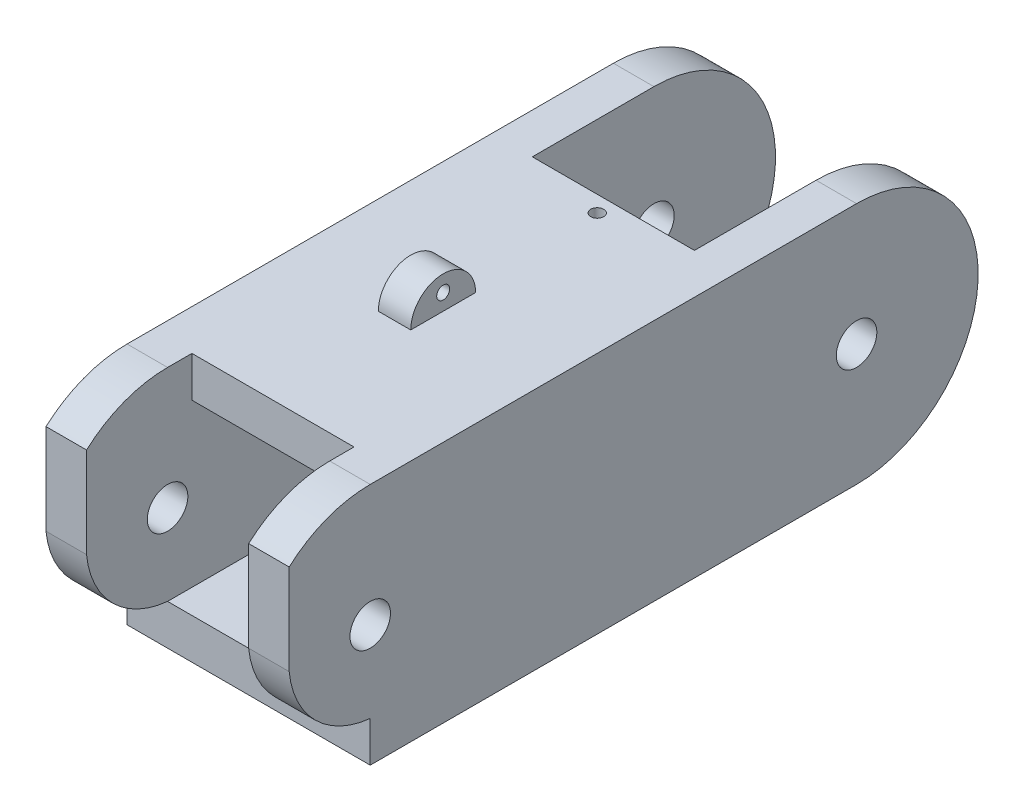
ISO-10303-21;
HEADER;
FILE_DESCRIPTION(('STEP AP214'),'2;1');
FILE_NAME('part.step','',(''),(''),'','','');
FILE_SCHEMA(('AUTOMOTIVE_DESIGN { 1 0 10303 214 1 1 1 1 }'));
ENDSEC;
DATA;
#1=APPLICATION_CONTEXT('core data for automotive mechanical design processes');
#2=APPLICATION_PROTOCOL_DEFINITION('international standard','automotive_design',2000,#1);
#3=PRODUCT_CONTEXT('',#1,'mechanical');
#4=PRODUCT('Part','Part','',(#3));
#5=PRODUCT_RELATED_PRODUCT_CATEGORY('part','',(#4));
#6=PRODUCT_DEFINITION_FORMATION('','',#4);
#7=PRODUCT_DEFINITION_CONTEXT('part definition',#1,'design');
#8=PRODUCT_DEFINITION('design','',#6,#7);
#9=PRODUCT_DEFINITION_SHAPE('','',#8);
#10=(LENGTH_UNIT() NAMED_UNIT(*) SI_UNIT(.MILLI.,.METRE.));
#11=(NAMED_UNIT(*) PLANE_ANGLE_UNIT() SI_UNIT($,.RADIAN.));
#12=(NAMED_UNIT(*) SI_UNIT($,.STERADIAN.) SOLID_ANGLE_UNIT());
#13=UNCERTAINTY_MEASURE_WITH_UNIT(LENGTH_MEASURE(1.E-05),#10,'distance_accuracy_value','');
#14=(GEOMETRIC_REPRESENTATION_CONTEXT(3) GLOBAL_UNCERTAINTY_ASSIGNED_CONTEXT((#13)) GLOBAL_UNIT_ASSIGNED_CONTEXT((#10,
#11,#12)) REPRESENTATION_CONTEXT('',''));
#15=CARTESIAN_POINT('',(0.,0.,0.));
#16=DIRECTION('',(0.,0.,1.));
#17=DIRECTION('',(1.,0.,0.));
#18=AXIS2_PLACEMENT_3D('',#15,#16,#17);
#19=CARTESIAN_POINT('',(19.05,9.525,-9.525));
#20=DIRECTION('',(-1.,0.,0.));
#21=DIRECTION('',(0.,0.,1.));
#22=AXIS2_PLACEMENT_3D('',#19,#20,#21);
#23=CYLINDRICAL_SURFACE('',#22,9.525);
#24=CARTESIAN_POINT('',(0.,9.525,-9.525));
#25=DIRECTION('',(-1.,0.,0.));
#26=DIRECTION('',(0.,0.,-1.));
#27=AXIS2_PLACEMENT_3D('',#24,#25,#26);
#28=CIRCLE('',#27,9.525);
#29=CARTESIAN_POINT('',(0.,16.6245158285618,-3.175));
#30=VERTEX_POINT('',#29);
#31=CARTESIAN_POINT('',(0.,19.05,-9.525));
#32=VERTEX_POINT('',#31);
#33=EDGE_CURVE('E301',#30,#32,#28,.T.);
#34=ORIENTED_EDGE('',*,*,#33,.F.);
#35=DIRECTION('',(-1.,0.,0.));
#36=VECTOR('',#35,1.);
#37=CARTESIAN_POINT('',(19.05,16.6245158285618,-3.17500000000001));
#38=LINE('',#37,#36);
#39=CARTESIAN_POINT('',(3.175,16.6245158285618,-3.17500000000001));
#40=VERTEX_POINT('',#39);
#41=EDGE_CURVE('E464',#30,#40,#38,.F.);
#42=ORIENTED_EDGE('',*,*,#41,.T.);
#43=CARTESIAN_POINT('',(3.175,9.525,-9.525));
#44=DIRECTION('',(-1.,0.,0.));
#45=DIRECTION('',(0.,-1.,0.));
#46=AXIS2_PLACEMENT_3D('',#43,#44,#45);
#47=CIRCLE('',#46,9.525);
#48=CARTESIAN_POINT('',(3.17500000000001,19.05,-9.525));
#49=VERTEX_POINT('',#48);
#50=EDGE_CURVE('E232',#40,#49,#47,.T.);
#51=ORIENTED_EDGE('',*,*,#50,.T.);
#52=DIRECTION('',(-1.,0.,0.));
#53=VECTOR('',#52,1.);
#54=CARTESIAN_POINT('',(19.05,19.05,-9.525));
#55=LINE('',#54,#53);
#56=EDGE_CURVE('E300',#49,#32,#55,.T.);
#57=ORIENTED_EDGE('',*,*,#56,.T.);
#58=EDGE_LOOP('',(#34,#42,#51,#57));
#59=FACE_BOUND('',#58,.T.);
#60=ADVANCED_FACE('F39',(#59),#23,.T.);
#61=CARTESIAN_POINT('',(0.,19.05,0.));
#62=DIRECTION('',(1.,0.,0.));
#63=DIRECTION('',(0.,0.,-1.));
#64=AXIS2_PLACEMENT_3D('',#61,#62,#63);
#65=PLANE('',#64);
#66=CARTESIAN_POINT('',(0.,9.525,-9.525));
#67=DIRECTION('',(1.,0.,0.));
#68=DIRECTION('',(0.,0.,-1.));
#69=AXIS2_PLACEMENT_3D('',#66,#67,#68);
#70=CIRCLE('',#69,1.5875);
#71=CARTESIAN_POINT('',(0.,9.525,-11.1125));
#72=VERTEX_POINT('',#71);
#73=EDGE_CURVE('E237',#72,#72,#70,.T.);
#74=ORIENTED_EDGE('',*,*,#73,.T.);
#75=EDGE_LOOP('',(#74));
#76=FACE_BOUND('',#75,.T.);
#77=CARTESIAN_POINT('',(0.,9.525,-47.625));
#78=DIRECTION('',(1.,0.,0.));
#79=DIRECTION('',(0.,0.,-1.));
#80=AXIS2_PLACEMENT_3D('',#77,#78,#79);
#81=CIRCLE('',#80,1.5875);
#82=CARTESIAN_POINT('',(0.,9.525,-49.2125));
#83=VERTEX_POINT('',#82);
#84=EDGE_CURVE('E372',#83,#83,#81,.T.);
#85=ORIENTED_EDGE('',*,*,#84,.T.);
#86=EDGE_LOOP('',(#85));
#87=FACE_BOUND('',#86,.T.);
#88=DIRECTION('',(0.,1.,0.));
#89=VECTOR('',#88,1.);
#90=CARTESIAN_POINT('',(0.,0.,-9.525));
#91=LINE('',#90,#89);
#92=CARTESIAN_POINT('',(0.,0.,-9.525));
#93=VERTEX_POINT('',#92);
#94=CARTESIAN_POINT('',(0.,3.175,-9.525));
#95=VERTEX_POINT('',#94);
#96=EDGE_CURVE('E184',#93,#95,#91,.T.);
#97=ORIENTED_EDGE('',*,*,#96,.T.);
#98=CARTESIAN_POINT('',(0.,10.2236491395655,-10.2236491395655));
#99=DIRECTION('',(-1.,0.,0.));
#100=DIRECTION('',(0.,0.,-1.));
#101=AXIS2_PLACEMENT_3D('',#98,#99,#100);
#102=CIRCLE('',#101,7.08318892257665);
#103=CARTESIAN_POINT('',(0.,9.525,-3.175));
#104=VERTEX_POINT('',#103);
#105=EDGE_CURVE('E758',#95,#104,#102,.T.);
#106=ORIENTED_EDGE('',*,*,#105,.T.);
#107=DIRECTION('',(0.,1.,0.));
#108=VECTOR('',#107,1.);
#109=CARTESIAN_POINT('',(0.,9.525,-3.175));
#110=LINE('',#109,#108);
#111=EDGE_CURVE('E201',#104,#30,#110,.T.);
#112=ORIENTED_EDGE('',*,*,#111,.T.);
#113=ORIENTED_EDGE('',*,*,#33,.T.);
#114=DIRECTION('',(0.,0.,1.));
#115=VECTOR('',#114,1.);
#116=CARTESIAN_POINT('',(0.,19.05,0.));
#117=LINE('',#116,#115);
#118=CARTESIAN_POINT('',(0.,19.05,-47.625));
#119=VERTEX_POINT('',#118);
#120=EDGE_CURVE('E209',#119,#32,#117,.T.);
#121=ORIENTED_EDGE('',*,*,#120,.F.);
#122=CARTESIAN_POINT('',(0.,9.525,-47.625));
#123=DIRECTION('',(-1.,0.,0.));
#124=DIRECTION('',(0.,0.,-1.));
#125=AXIS2_PLACEMENT_3D('',#122,#123,#124);
#126=CIRCLE('',#125,9.525);
#127=CARTESIAN_POINT('',(0.,0.,-47.625));
#128=VERTEX_POINT('',#127);
#129=EDGE_CURVE('E491',#119,#128,#126,.T.);
#130=ORIENTED_EDGE('',*,*,#129,.T.);
#131=DIRECTION('',(0.,0.,1.));
#132=VECTOR('',#131,1.);
#133=CARTESIAN_POINT('',(0.,0.,0.));
#134=LINE('',#133,#132);
#135=EDGE_CURVE('E210',#128,#93,#134,.T.);
#136=ORIENTED_EDGE('',*,*,#135,.T.);
#137=EDGE_LOOP('',(#97,#106,#112,#113,#121,#130,#136));
#138=FACE_BOUND('',#137,.T.);
#139=ADVANCED_FACE('F41',(#76,#87,#138),#65,.F.);
#140=CARTESIAN_POINT('',(19.05,19.05,0.));
#141=DIRECTION('',(-1.,0.,0.));
#142=DIRECTION('',(0.,0.,1.));
#143=AXIS2_PLACEMENT_3D('',#140,#141,#142);
#144=PLANE('',#143);
#145=CARTESIAN_POINT('',(19.05,9.525,-9.525));
#146=DIRECTION('',(1.,0.,0.));
#147=DIRECTION('',(0.,0.,-1.));
#148=AXIS2_PLACEMENT_3D('',#145,#146,#147);
#149=CIRCLE('',#148,1.5875);
#150=CARTESIAN_POINT('',(19.05,9.525,-11.1125));
#151=VERTEX_POINT('',#150);
#152=EDGE_CURVE('E305',#151,#151,#149,.T.);
#153=ORIENTED_EDGE('',*,*,#152,.F.);
#154=EDGE_LOOP('',(#153));
#155=FACE_BOUND('',#154,.T.);
#156=CARTESIAN_POINT('',(19.05,9.525,-47.625));
#157=DIRECTION('',(1.,0.,0.));
#158=DIRECTION('',(0.,0.,-1.));
#159=AXIS2_PLACEMENT_3D('',#156,#157,#158);
#160=CIRCLE('',#159,1.5875);
#161=CARTESIAN_POINT('',(19.05,9.525,-49.2125));
#162=VERTEX_POINT('',#161);
#163=EDGE_CURVE('E243',#162,#162,#160,.T.);
#164=ORIENTED_EDGE('',*,*,#163,.F.);
#165=EDGE_LOOP('',(#164));
#166=FACE_BOUND('',#165,.T.);
#167=DIRECTION('',(0.,1.,0.));
#168=VECTOR('',#167,1.);
#169=CARTESIAN_POINT('',(19.05,0.,-9.525));
#170=LINE('',#169,#168);
#171=CARTESIAN_POINT('',(19.05,0.,-9.525));
#172=VERTEX_POINT('',#171);
#173=CARTESIAN_POINT('',(19.05,3.175,-9.525));
#174=VERTEX_POINT('',#173);
#175=EDGE_CURVE('E181',#172,#174,#170,.T.);
#176=ORIENTED_EDGE('',*,*,#175,.F.);
#177=DIRECTION('',(0.,0.,-1.));
#178=VECTOR('',#177,1.);
#179=CARTESIAN_POINT('',(19.05,0.,0.));
#180=LINE('',#179,#178);
#181=CARTESIAN_POINT('',(19.05,0.,-47.625));
#182=VERTEX_POINT('',#181);
#183=EDGE_CURVE('E198',#172,#182,#180,.T.);
#184=ORIENTED_EDGE('',*,*,#183,.T.);
#185=CARTESIAN_POINT('',(19.05,9.525,-47.625));
#186=DIRECTION('',(-1.,0.,0.));
#187=DIRECTION('',(0.,0.,-1.));
#188=AXIS2_PLACEMENT_3D('',#185,#186,#187);
#189=CIRCLE('',#188,9.525);
#190=CARTESIAN_POINT('',(19.05,19.05,-47.625));
#191=VERTEX_POINT('',#190);
#192=EDGE_CURVE('E492',#191,#182,#189,.T.);
#193=ORIENTED_EDGE('',*,*,#192,.F.);
#194=DIRECTION('',(0.,0.,-1.));
#195=VECTOR('',#194,1.);
#196=CARTESIAN_POINT('',(19.05,19.05,0.));
#197=LINE('',#196,#195);
#198=CARTESIAN_POINT('',(19.05,19.05,-9.525));
#199=VERTEX_POINT('',#198);
#200=EDGE_CURVE('E215',#199,#191,#197,.T.);
#201=ORIENTED_EDGE('',*,*,#200,.F.);
#202=CARTESIAN_POINT('',(19.05,9.525,-9.525));
#203=DIRECTION('',(-1.,0.,0.));
#204=DIRECTION('',(0.,0.,-1.));
#205=AXIS2_PLACEMENT_3D('',#202,#203,#204);
#206=CIRCLE('',#205,9.525);
#207=CARTESIAN_POINT('',(19.05,16.6245158285618,-3.175));
#208=VERTEX_POINT('',#207);
#209=EDGE_CURVE('E304',#208,#199,#206,.T.);
#210=ORIENTED_EDGE('',*,*,#209,.F.);
#211=DIRECTION('',(0.,1.,0.));
#212=VECTOR('',#211,1.);
#213=CARTESIAN_POINT('',(19.05,9.525,-3.175));
#214=LINE('',#213,#212);
#215=CARTESIAN_POINT('',(19.05,9.525,-3.175));
#216=VERTEX_POINT('',#215);
#217=EDGE_CURVE('E63',#216,#208,#214,.T.);
#218=ORIENTED_EDGE('',*,*,#217,.F.);
#219=CARTESIAN_POINT('',(19.05,10.2236491395655,-10.2236491395655));
#220=DIRECTION('',(-1.,0.,0.));
#221=DIRECTION('',(0.,0.,-1.));
#222=AXIS2_PLACEMENT_3D('',#219,#220,#221);
#223=CIRCLE('',#222,7.08318892257665);
#224=EDGE_CURVE('E199',#174,#216,#223,.T.);
#225=ORIENTED_EDGE('',*,*,#224,.F.);
#226=EDGE_LOOP('',(#176,#184,#193,#201,#210,#218,#225));
#227=FACE_BOUND('',#226,.T.);
#228=ADVANCED_FACE('F196',(#155,#166,#227),#144,.F.);
#229=CARTESIAN_POINT('',(3.175,15.875,-76.2));
#230=DIRECTION('',(-1.,0.,0.));
#231=DIRECTION('',(0.,-1.,0.));
#232=AXIS2_PLACEMENT_3D('',#229,#230,#231);
#233=PLANE('',#232);
#234=CARTESIAN_POINT('',(3.175,9.525,-47.625));
#235=DIRECTION('',(-1.,0.,0.));
#236=DIRECTION('',(0.,-1.,0.));
#237=AXIS2_PLACEMENT_3D('',#234,#235,#236);
#238=CIRCLE('',#237,1.5875);
#239=CARTESIAN_POINT('',(3.175,7.9375,-47.625));
#240=VERTEX_POINT('',#239);
#241=EDGE_CURVE('E242',#240,#240,#238,.F.);
#242=ORIENTED_EDGE('',*,*,#241,.F.);
#243=EDGE_LOOP('',(#242));
#244=FACE_BOUND('',#243,.T.);
#245=CARTESIAN_POINT('',(3.175,9.525,-9.525));
#246=DIRECTION('',(-1.,0.,0.));
#247=DIRECTION('',(0.,-1.,0.));
#248=AXIS2_PLACEMENT_3D('',#245,#246,#247);
#249=CIRCLE('',#248,1.5875);
#250=CARTESIAN_POINT('',(3.175,7.9375,-9.525));
#251=VERTEX_POINT('',#250);
#252=EDGE_CURVE('E231',#251,#251,#249,.F.);
#253=ORIENTED_EDGE('',*,*,#252,.F.);
#254=EDGE_LOOP('',(#253));
#255=FACE_BOUND('',#254,.T.);
#256=CARTESIAN_POINT('',(3.175,10.2236491395655,-10.2236491395655));
#257=DIRECTION('',(-1.,0.,0.));
#258=DIRECTION('',(0.,-1.,0.));
#259=AXIS2_PLACEMENT_3D('',#256,#257,#258);
#260=CIRCLE('',#259,7.08318892257665);
#261=CARTESIAN_POINT('',(3.17500000000001,3.175,-9.525));
#262=VERTEX_POINT('',#261);
#263=CARTESIAN_POINT('',(3.175,9.525,-3.17500000000001));
#264=VERTEX_POINT('',#263);
#265=EDGE_CURVE('E431',#262,#264,#260,.T.);
#266=ORIENTED_EDGE('',*,*,#265,.F.);
#267=DIRECTION('',(0.,0.,1.));
#268=VECTOR('',#267,1.);
#269=CARTESIAN_POINT('',(3.175,3.175,-76.2));
#270=LINE('',#269,#268);
#271=CARTESIAN_POINT('',(3.175,3.175,-47.625));
#272=VERTEX_POINT('',#271);
#273=EDGE_CURVE('E254',#272,#262,#270,.T.);
#274=ORIENTED_EDGE('',*,*,#273,.F.);
#275=DIRECTION('',(0.,-1.,0.));
#276=VECTOR('',#275,1.);
#277=CARTESIAN_POINT('',(3.175,3.81,-47.625));
#278=LINE('',#277,#276);
#279=CARTESIAN_POINT('',(3.175,0.,-47.625));
#280=VERTEX_POINT('',#279);
#281=EDGE_CURVE('E458',#272,#280,#278,.T.);
#282=ORIENTED_EDGE('',*,*,#281,.T.);
#283=CARTESIAN_POINT('',(3.175,9.525,-47.625));
#284=DIRECTION('',(-1.,0.,0.));
#285=DIRECTION('',(0.,-1.,0.));
#286=AXIS2_PLACEMENT_3D('',#283,#284,#285);
#287=CIRCLE('',#286,9.525);
#288=CARTESIAN_POINT('',(3.175,19.05,-47.625));
#289=VERTEX_POINT('',#288);
#290=EDGE_CURVE('E384',#289,#280,#287,.T.);
#291=ORIENTED_EDGE('',*,*,#290,.F.);
#292=DIRECTION('',(0.,0.,1.));
#293=VECTOR('',#292,1.);
#294=CARTESIAN_POINT('',(3.175,19.05,-69.0709609780491));
#295=LINE('',#294,#293);
#296=CARTESIAN_POINT('',(3.175,19.05,-38.1));
#297=VERTEX_POINT('',#296);
#298=EDGE_CURVE('E470',#289,#297,#295,.T.);
#299=ORIENTED_EDGE('',*,*,#298,.T.);
#300=DIRECTION('',(0.,1.,0.));
#301=VECTOR('',#300,1.);
#302=CARTESIAN_POINT('',(3.175,15.24,-38.1));
#303=LINE('',#302,#301);
#304=CARTESIAN_POINT('',(3.175,15.875,-38.1));
#305=VERTEX_POINT('',#304);
#306=EDGE_CURVE('E481',#305,#297,#303,.T.);
#307=ORIENTED_EDGE('',*,*,#306,.F.);
#308=DIRECTION('',(0.,0.,1.));
#309=VECTOR('',#308,1.);
#310=CARTESIAN_POINT('',(3.175,15.875,-76.2));
#311=LINE('',#310,#309);
#312=CARTESIAN_POINT('',(3.17500000000001,15.875,-11.43));
#313=VERTEX_POINT('',#312);
#314=EDGE_CURVE('E217',#305,#313,#311,.T.);
#315=ORIENTED_EDGE('',*,*,#314,.T.);
#316=DIRECTION('',(0.,1.,0.));
#317=VECTOR('',#316,1.);
#318=CARTESIAN_POINT('',(3.17500000000001,6.35,-11.43));
#319=LINE('',#318,#317);
#320=CARTESIAN_POINT('',(3.17500000000001,19.05,-11.43));
#321=VERTEX_POINT('',#320);
#322=EDGE_CURVE('E405',#313,#321,#319,.T.);
#323=ORIENTED_EDGE('',*,*,#322,.T.);
#324=DIRECTION('',(0.,0.,1.));
#325=VECTOR('',#324,1.);
#326=CARTESIAN_POINT('',(3.17500000000001,19.05,0.));
#327=LINE('',#326,#325);
#328=EDGE_CURVE('E400',#321,#49,#327,.T.);
#329=ORIENTED_EDGE('',*,*,#328,.T.);
#330=ORIENTED_EDGE('',*,*,#50,.F.);
#331=DIRECTION('',(0.,1.,0.));
#332=VECTOR('',#331,1.);
#333=CARTESIAN_POINT('',(3.175,15.875,-3.17500000000001));
#334=LINE('',#333,#332);
#335=EDGE_CURVE('E434',#264,#40,#334,.T.);
#336=ORIENTED_EDGE('',*,*,#335,.F.);
#337=EDGE_LOOP('',(#266,#274,#282,#291,#299,#307,#315,#323,#329,#330,#336));
#338=FACE_BOUND('',#337,.T.);
#339=ADVANCED_FACE('F345',(#244,#255,#338),#233,.F.);
#340=CARTESIAN_POINT('',(15.875,15.875,-76.2));
#341=DIRECTION('',(1.,0.,0.));
#342=DIRECTION('',(0.,1.,0.));
#343=AXIS2_PLACEMENT_3D('',#340,#341,#342);
#344=PLANE('',#343);
#345=CARTESIAN_POINT('',(15.875,9.525,-47.625));
#346=DIRECTION('',(1.,0.,0.));
#347=DIRECTION('',(0.,1.,0.));
#348=AXIS2_PLACEMENT_3D('',#345,#346,#347);
#349=CIRCLE('',#348,1.5875);
#350=CARTESIAN_POINT('',(15.875,11.1125,-47.625));
#351=VERTEX_POINT('',#350);
#352=EDGE_CURVE('E239',#351,#351,#349,.F.);
#353=ORIENTED_EDGE('',*,*,#352,.F.);
#354=EDGE_LOOP('',(#353));
#355=FACE_BOUND('',#354,.T.);
#356=CARTESIAN_POINT('',(15.875,9.525,-9.525));
#357=DIRECTION('',(1.,0.,0.));
#358=DIRECTION('',(0.,1.,0.));
#359=AXIS2_PLACEMENT_3D('',#356,#357,#358);
#360=CIRCLE('',#359,1.5875);
#361=CARTESIAN_POINT('',(15.875,11.1125,-9.525));
#362=VERTEX_POINT('',#361);
#363=EDGE_CURVE('E227',#362,#362,#360,.F.);
#364=ORIENTED_EDGE('',*,*,#363,.F.);
#365=EDGE_LOOP('',(#364));
#366=FACE_BOUND('',#365,.T.);
#367=CARTESIAN_POINT('',(15.875,10.2236491395655,-10.2236491395655));
#368=DIRECTION('',(1.,0.,0.));
#369=DIRECTION('',(0.,1.,0.));
#370=AXIS2_PLACEMENT_3D('',#367,#368,#369);
#371=CIRCLE('',#370,7.08318892257665);
#372=CARTESIAN_POINT('',(15.875,9.525,-3.175));
#373=VERTEX_POINT('',#372);
#374=CARTESIAN_POINT('',(15.875,3.175,-9.525));
#375=VERTEX_POINT('',#374);
#376=EDGE_CURVE('E438',#373,#375,#371,.T.);
#377=ORIENTED_EDGE('',*,*,#376,.F.);
#378=DIRECTION('',(0.,-1.,0.));
#379=VECTOR('',#378,1.);
#380=CARTESIAN_POINT('',(15.875,15.875,-3.17500000000001));
#381=LINE('',#380,#379);
#382=CARTESIAN_POINT('',(15.875,16.6245158285618,-3.17500000000001));
#383=VERTEX_POINT('',#382);
#384=EDGE_CURVE('E437',#383,#373,#381,.T.);
#385=ORIENTED_EDGE('',*,*,#384,.F.);
#386=CARTESIAN_POINT('',(15.875,9.525,-9.525));
#387=DIRECTION('',(1.,0.,0.));
#388=DIRECTION('',(0.,1.,0.));
#389=AXIS2_PLACEMENT_3D('',#386,#387,#388);
#390=CIRCLE('',#389,9.525);
#391=CARTESIAN_POINT('',(15.875,19.05,-9.525));
#392=VERTEX_POINT('',#391);
#393=EDGE_CURVE('E286',#392,#383,#390,.T.);
#394=ORIENTED_EDGE('',*,*,#393,.F.);
#395=DIRECTION('',(0.,0.,-1.));
#396=VECTOR('',#395,1.);
#397=CARTESIAN_POINT('',(15.875,19.05,0.));
#398=LINE('',#397,#396);
#399=CARTESIAN_POINT('',(15.875,19.05,-11.43));
#400=VERTEX_POINT('',#399);
#401=EDGE_CURVE('E392',#392,#400,#398,.T.);
#402=ORIENTED_EDGE('',*,*,#401,.T.);
#403=DIRECTION('',(0.,1.,0.));
#404=VECTOR('',#403,1.);
#405=CARTESIAN_POINT('',(15.875,6.35,-11.43));
#406=LINE('',#405,#404);
#407=CARTESIAN_POINT('',(15.875,15.875,-11.43));
#408=VERTEX_POINT('',#407);
#409=EDGE_CURVE('E404',#408,#400,#406,.T.);
#410=ORIENTED_EDGE('',*,*,#409,.F.);
#411=DIRECTION('',(0.,0.,1.));
#412=VECTOR('',#411,1.);
#413=CARTESIAN_POINT('',(15.875,15.875,-76.2));
#414=LINE('',#413,#412);
#415=CARTESIAN_POINT('',(15.875,15.875,-38.1));
#416=VERTEX_POINT('',#415);
#417=EDGE_CURVE('E263',#416,#408,#414,.T.);
#418=ORIENTED_EDGE('',*,*,#417,.F.);
#419=DIRECTION('',(0.,1.,0.));
#420=VECTOR('',#419,1.);
#421=CARTESIAN_POINT('',(15.875,15.24,-38.1));
#422=LINE('',#421,#420);
#423=CARTESIAN_POINT('',(15.875,19.05,-38.1));
#424=VERTEX_POINT('',#423);
#425=EDGE_CURVE('E482',#416,#424,#422,.T.);
#426=ORIENTED_EDGE('',*,*,#425,.T.);
#427=DIRECTION('',(0.,0.,-1.));
#428=VECTOR('',#427,1.);
#429=CARTESIAN_POINT('',(15.875,19.05,-69.0709609780491));
#430=LINE('',#429,#428);
#431=CARTESIAN_POINT('',(15.875,19.05,-47.625));
#432=VERTEX_POINT('',#431);
#433=EDGE_CURVE('E478',#424,#432,#430,.T.);
#434=ORIENTED_EDGE('',*,*,#433,.T.);
#435=CARTESIAN_POINT('',(15.875,9.525,-47.625));
#436=DIRECTION('',(1.,0.,0.));
#437=DIRECTION('',(0.,1.,0.));
#438=AXIS2_PLACEMENT_3D('',#435,#436,#437);
#439=CIRCLE('',#438,9.525);
#440=CARTESIAN_POINT('',(15.875,0.,-47.625));
#441=VERTEX_POINT('',#440);
#442=EDGE_CURVE('E48',#441,#432,#439,.T.);
#443=ORIENTED_EDGE('',*,*,#442,.F.);
#444=DIRECTION('',(0.,-1.,0.));
#445=VECTOR('',#444,1.);
#446=CARTESIAN_POINT('',(15.875,3.81,-47.625));
#447=LINE('',#446,#445);
#448=CARTESIAN_POINT('',(15.875,3.175,-47.625));
#449=VERTEX_POINT('',#448);
#450=EDGE_CURVE('E454',#449,#441,#447,.T.);
#451=ORIENTED_EDGE('',*,*,#450,.F.);
#452=DIRECTION('',(0.,0.,1.));
#453=VECTOR('',#452,1.);
#454=CARTESIAN_POINT('',(15.875,3.175,-76.2));
#455=LINE('',#454,#453);
#456=EDGE_CURVE('E258',#449,#375,#455,.T.);
#457=ORIENTED_EDGE('',*,*,#456,.T.);
#458=EDGE_LOOP('',(#377,#385,#394,#402,#410,#418,#426,#434,#443,#451,#457));
#459=FACE_BOUND('',#458,.T.);
#460=ADVANCED_FACE('F342',(#355,#366,#459),#344,.F.);
#461=ORIENTED_EDGE('',*,*,#393,.T.);
#462=DIRECTION('',(-1.,0.,0.));
#463=VECTOR('',#462,1.);
#464=CARTESIAN_POINT('',(19.05,16.6245158285618,-3.17500000000001));
#465=LINE('',#464,#463);
#466=EDGE_CURVE('E11',#383,#208,#465,.F.);
#467=ORIENTED_EDGE('',*,*,#466,.T.);
#468=ORIENTED_EDGE('',*,*,#209,.T.);
#469=EDGE_CURVE('E191',#199,#392,#55,.T.);
#470=ORIENTED_EDGE('',*,*,#469,.T.);
#471=EDGE_LOOP('',(#461,#467,#468,#470));
#472=FACE_BOUND('',#471,.T.);
#473=ADVANCED_FACE('F324',(#472),#23,.T.);
#474=CARTESIAN_POINT('',(3.175,3.175,-76.2));
#475=DIRECTION('',(0.,-1.,0.));
#476=DIRECTION('',(0.,0.,-1.));
#477=AXIS2_PLACEMENT_3D('',#474,#475,#476);
#478=PLANE('',#477);
#479=DIRECTION('',(1.,0.,0.));
#480=VECTOR('',#479,1.);
#481=CARTESIAN_POINT('',(3.175,3.175,-47.625));
#482=LINE('',#481,#480);
#483=EDGE_CURVE('E442',#272,#449,#482,.T.);
#484=ORIENTED_EDGE('',*,*,#483,.F.);
#485=ORIENTED_EDGE('',*,*,#273,.T.);
#486=DIRECTION('',(1.,0.,0.));
#487=VECTOR('',#486,1.);
#488=CARTESIAN_POINT('',(3.175,3.175,-9.52500000000001));
#489=LINE('',#488,#487);
#490=EDGE_CURVE('E387',#262,#375,#489,.T.);
#491=ORIENTED_EDGE('',*,*,#490,.T.);
#492=ORIENTED_EDGE('',*,*,#456,.F.);
#493=EDGE_LOOP('',(#484,#485,#491,#492));
#494=FACE_BOUND('',#493,.T.);
#495=ADVANCED_FACE('F347',(#494),#478,.F.);
#496=CARTESIAN_POINT('',(19.05,9.525,-47.625));
#497=DIRECTION('',(-1.,0.,0.));
#498=DIRECTION('',(0.,0.,1.));
#499=AXIS2_PLACEMENT_3D('',#496,#497,#498);
#500=CYLINDRICAL_SURFACE('',#499,9.525);
#501=ORIENTED_EDGE('',*,*,#290,.T.);
#502=DIRECTION('',(-1.,0.,0.));
#503=VECTOR('',#502,1.);
#504=CARTESIAN_POINT('',(19.05,0.,-47.625));
#505=LINE('',#504,#503);
#506=EDGE_CURVE('E495',#280,#128,#505,.T.);
#507=ORIENTED_EDGE('',*,*,#506,.T.);
#508=ORIENTED_EDGE('',*,*,#129,.F.);
#509=DIRECTION('',(-1.,0.,0.));
#510=VECTOR('',#509,1.);
#511=CARTESIAN_POINT('',(19.05,19.05,-47.625));
#512=LINE('',#511,#510);
#513=EDGE_CURVE('E499',#289,#119,#512,.T.);
#514=ORIENTED_EDGE('',*,*,#513,.F.);
#515=EDGE_LOOP('',(#501,#507,#508,#514));
#516=FACE_BOUND('',#515,.T.);
#517=ADVANCED_FACE('F350',(#516),#500,.T.);
#518=EDGE_CURVE('E207',#182,#441,#505,.T.);
#519=ORIENTED_EDGE('',*,*,#518,.T.);
#520=ORIENTED_EDGE('',*,*,#442,.T.);
#521=EDGE_CURVE('E376',#191,#432,#512,.T.);
#522=ORIENTED_EDGE('',*,*,#521,.F.);
#523=ORIENTED_EDGE('',*,*,#192,.T.);
#524=EDGE_LOOP('',(#519,#520,#522,#523));
#525=FACE_BOUND('',#524,.T.);
#526=ADVANCED_FACE('F340',(#525),#500,.T.);
#527=CARTESIAN_POINT('',(3.175,15.875,-76.2));
#528=DIRECTION('',(0.,1.,0.));
#529=DIRECTION('',(0.,0.,1.));
#530=AXIS2_PLACEMENT_3D('',#527,#528,#529);
#531=PLANE('',#530);
#532=CARTESIAN_POINT('',(9.525,15.875,-36.83));
#533=DIRECTION('',(0.,1.,0.));
#534=DIRECTION('',(0.,0.,1.));
#535=AXIS2_PLACEMENT_3D('',#532,#533,#534);
#536=CIRCLE('',#535,0.507999999999999);
#537=CARTESIAN_POINT('',(9.525,15.875,-36.322));
#538=VERTEX_POINT('',#537);
#539=EDGE_CURVE('E233',#538,#538,#536,.T.);
#540=ORIENTED_EDGE('',*,*,#539,.T.);
#541=EDGE_LOOP('',(#540));
#542=FACE_BOUND('',#541,.T.);
#543=ORIENTED_EDGE('',*,*,#314,.F.);
#544=DIRECTION('',(1.,0.,0.));
#545=VECTOR('',#544,1.);
#546=CARTESIAN_POINT('',(3.175,15.875,-38.1));
#547=LINE('',#546,#545);
#548=EDGE_CURVE('E485',#305,#416,#547,.T.);
#549=ORIENTED_EDGE('',*,*,#548,.T.);
#550=ORIENTED_EDGE('',*,*,#417,.T.);
#551=DIRECTION('',(-1.,0.,0.));
#552=VECTOR('',#551,1.);
#553=CARTESIAN_POINT('',(3.175,15.875,-11.43));
#554=LINE('',#553,#552);
#555=EDGE_CURVE('E238',#408,#313,#554,.T.);
#556=ORIENTED_EDGE('',*,*,#555,.T.);
#557=EDGE_LOOP('',(#543,#549,#550,#556));
#558=FACE_BOUND('',#557,.T.);
#559=ADVANCED_FACE('F336',(#542,#558),#531,.F.);
#560=CARTESIAN_POINT('',(0.,19.05,0.));
#561=DIRECTION('',(0.,-1.,0.));
#562=DIRECTION('',(0.,0.,-1.));
#563=AXIS2_PLACEMENT_3D('',#560,#561,#562);
#564=PLANE('',#563);
#565=CARTESIAN_POINT('',(9.525,19.05,-36.83));
#566=DIRECTION('',(0.,1.,0.));
#567=DIRECTION('',(0.,0.,1.));
#568=AXIS2_PLACEMENT_3D('',#565,#566,#567);
#569=CIRCLE('',#568,0.507999999999999);
#570=CARTESIAN_POINT('',(9.525,19.05,-36.322));
#571=VERTEX_POINT('',#570);
#572=EDGE_CURVE('E391',#571,#571,#569,.T.);
#573=ORIENTED_EDGE('',*,*,#572,.F.);
#574=EDGE_LOOP('',(#573));
#575=FACE_BOUND('',#574,.T.);
#576=DIRECTION('',(1.,0.,0.));
#577=VECTOR('',#576,1.);
#578=CARTESIAN_POINT('',(7.62,19.05,-21.59));
#579=LINE('',#578,#577);
#580=CARTESIAN_POINT('',(7.62,19.05,-21.59));
#581=VERTEX_POINT('',#580);
#582=CARTESIAN_POINT('',(10.16,19.05,-21.59));
#583=VERTEX_POINT('',#582);
#584=EDGE_CURVE('E274',#581,#583,#579,.T.);
#585=ORIENTED_EDGE('',*,*,#584,.F.);
#586=DIRECTION('',(0.,0.,1.));
#587=VECTOR('',#586,1.);
#588=CARTESIAN_POINT('',(7.62,19.05,-26.67));
#589=LINE('',#588,#587);
#590=CARTESIAN_POINT('',(7.62,19.05,-26.67));
#591=VERTEX_POINT('',#590);
#592=EDGE_CURVE('E277',#591,#581,#589,.T.);
#593=ORIENTED_EDGE('',*,*,#592,.F.);
#594=DIRECTION('',(-1.,0.,0.));
#595=VECTOR('',#594,1.);
#596=CARTESIAN_POINT('',(7.62,19.05,-26.67));
#597=LINE('',#596,#595);
#598=CARTESIAN_POINT('',(10.16,19.05,-26.67));
#599=VERTEX_POINT('',#598);
#600=EDGE_CURVE('E259',#599,#591,#597,.T.);
#601=ORIENTED_EDGE('',*,*,#600,.F.);
#602=DIRECTION('',(0.,0.,-1.));
#603=VECTOR('',#602,1.);
#604=CARTESIAN_POINT('',(10.16,19.05,-26.67));
#605=LINE('',#604,#603);
#606=EDGE_CURVE('E270',#583,#599,#605,.T.);
#607=ORIENTED_EDGE('',*,*,#606,.F.);
#608=EDGE_LOOP('',(#585,#593,#601,#607));
#609=FACE_BOUND('',#608,.T.);
#610=DIRECTION('',(1.,0.,0.));
#611=VECTOR('',#610,1.);
#612=CARTESIAN_POINT('',(3.175,19.05,-38.1));
#613=LINE('',#612,#611);
#614=EDGE_CURVE('E474',#297,#424,#613,.T.);
#615=ORIENTED_EDGE('',*,*,#614,.F.);
#616=ORIENTED_EDGE('',*,*,#298,.F.);
#617=ORIENTED_EDGE('',*,*,#513,.T.);
#618=ORIENTED_EDGE('',*,*,#120,.T.);
#619=ORIENTED_EDGE('',*,*,#56,.F.);
#620=ORIENTED_EDGE('',*,*,#328,.F.);
#621=DIRECTION('',(-1.,0.,0.));
#622=VECTOR('',#621,1.);
#623=CARTESIAN_POINT('',(3.17500000000001,19.05,-11.43));
#624=LINE('',#623,#622);
#625=EDGE_CURVE('E396',#400,#321,#624,.T.);
#626=ORIENTED_EDGE('',*,*,#625,.F.);
#627=ORIENTED_EDGE('',*,*,#401,.F.);
#628=ORIENTED_EDGE('',*,*,#469,.F.);
#629=ORIENTED_EDGE('',*,*,#200,.T.);
#630=ORIENTED_EDGE('',*,*,#521,.T.);
#631=ORIENTED_EDGE('',*,*,#433,.F.);
#632=EDGE_LOOP('',(#615,#616,#617,#618,#619,#620,#626,#627,#628,#629,#630,#631));
#633=FACE_BOUND('',#632,.T.);
#634=ADVANCED_FACE('F339',(#575,#609,#633),#564,.F.);
#635=CARTESIAN_POINT('',(0.,0.,0.));
#636=DIRECTION('',(0.,-1.,0.));
#637=DIRECTION('',(0.,0.,-1.));
#638=AXIS2_PLACEMENT_3D('',#635,#636,#637);
#639=PLANE('',#638);
#640=ORIENTED_EDGE('',*,*,#518,.F.);
#641=ORIENTED_EDGE('',*,*,#183,.F.);
#642=DIRECTION('',(-1.,0.,0.));
#643=VECTOR('',#642,1.);
#644=CARTESIAN_POINT('',(19.05,0.,-9.525));
#645=LINE('',#644,#643);
#646=EDGE_CURVE('E176',#172,#93,#645,.T.);
#647=ORIENTED_EDGE('',*,*,#646,.T.);
#648=ORIENTED_EDGE('',*,*,#135,.F.);
#649=ORIENTED_EDGE('',*,*,#506,.F.);
#650=DIRECTION('',(1.,0.,0.));
#651=VECTOR('',#650,1.);
#652=CARTESIAN_POINT('',(3.175,0.,-47.625));
#653=LINE('',#652,#651);
#654=EDGE_CURVE('E459',#280,#441,#653,.T.);
#655=ORIENTED_EDGE('',*,*,#654,.T.);
#656=EDGE_LOOP('',(#640,#641,#647,#648,#649,#655));
#657=FACE_BOUND('',#656,.T.);
#658=ADVANCED_FACE('F204',(#657),#639,.T.);
#659=CARTESIAN_POINT('',(7.62,21.59,-26.67));
#660=DIRECTION('',(1.,0.,0.));
#661=DIRECTION('',(0.,0.,-1.));
#662=AXIS2_PLACEMENT_3D('',#659,#660,#661);
#663=PLANE('',#662);
#664=CARTESIAN_POINT('',(7.62,19.05,-24.13));
#665=DIRECTION('',(-1.,0.,0.));
#666=DIRECTION('',(0.,-1.,0.));
#667=AXIS2_PLACEMENT_3D('',#664,#665,#666);
#668=ELLIPSE('',#667,2.54,2.54);
#669=EDGE_CURVE('E226',#591,#581,#668,.F.);
#670=ORIENTED_EDGE('',*,*,#669,.F.);
#671=ORIENTED_EDGE('',*,*,#592,.T.);
#672=EDGE_LOOP('',(#670,#671));
#673=FACE_BOUND('',#672,.T.);
#674=CARTESIAN_POINT('',(7.62,20.32,-24.13));
#675=DIRECTION('',(1.,0.,0.));
#676=DIRECTION('',(0.,0.,-1.));
#677=AXIS2_PLACEMENT_3D('',#674,#675,#676);
#678=CIRCLE('',#677,0.508000000000002);
#679=CARTESIAN_POINT('',(7.62,20.32,-24.638));
#680=VERTEX_POINT('',#679);
#681=EDGE_CURVE('E225',#680,#680,#678,.F.);
#682=ORIENTED_EDGE('',*,*,#681,.F.);
#683=EDGE_LOOP('',(#682));
#684=FACE_BOUND('',#683,.T.);
#685=ADVANCED_FACE('F331',(#673,#684),#663,.F.);
#686=CARTESIAN_POINT('',(10.16,21.59,-26.67));
#687=DIRECTION('',(-1.,0.,0.));
#688=DIRECTION('',(0.,0.,1.));
#689=AXIS2_PLACEMENT_3D('',#686,#687,#688);
#690=PLANE('',#689);
#691=CARTESIAN_POINT('',(10.16,19.05,-24.13));
#692=DIRECTION('',(-1.,0.,0.));
#693=DIRECTION('',(0.,-1.,0.));
#694=AXIS2_PLACEMENT_3D('',#691,#692,#693);
#695=ELLIPSE('',#694,2.54,2.54);
#696=EDGE_CURVE('E190',#583,#599,#695,.T.);
#697=ORIENTED_EDGE('',*,*,#696,.F.);
#698=ORIENTED_EDGE('',*,*,#606,.T.);
#699=EDGE_LOOP('',(#697,#698));
#700=FACE_BOUND('',#699,.T.);
#701=CARTESIAN_POINT('',(10.16,20.32,-24.13));
#702=DIRECTION('',(-1.,0.,0.));
#703=DIRECTION('',(0.,0.,1.));
#704=AXIS2_PLACEMENT_3D('',#701,#702,#703);
#705=CIRCLE('',#704,0.508000000000002);
#706=CARTESIAN_POINT('',(10.16,20.32,-23.622));
#707=VERTEX_POINT('',#706);
#708=EDGE_CURVE('E221',#707,#707,#705,.F.);
#709=ORIENTED_EDGE('',*,*,#708,.F.);
#710=EDGE_LOOP('',(#709));
#711=FACE_BOUND('',#710,.T.);
#712=ADVANCED_FACE('F317',(#700,#711),#690,.F.);
#713=CARTESIAN_POINT('',(19.05,19.05,-24.13));
#714=DIRECTION('',(-1.,0.,0.));
#715=DIRECTION('',(0.,-1.,0.));
#716=AXIS2_PLACEMENT_3D('',#713,#714,#715);
#717=ELLIPSE('',#716,2.54,2.54);
#718=DIRECTION('',(-1.,0.,0.));
#719=VECTOR('',#718,1.);
#720=SURFACE_OF_LINEAR_EXTRUSION('',#717,#719);
#721=ORIENTED_EDGE('',*,*,#669,.T.);
#722=ORIENTED_EDGE('',*,*,#584,.T.);
#723=ORIENTED_EDGE('',*,*,#696,.T.);
#724=ORIENTED_EDGE('',*,*,#600,.T.);
#725=EDGE_LOOP('',(#721,#722,#723,#724));
#726=FACE_BOUND('',#725,.T.);
#727=ADVANCED_FACE('F312',(#726),#720,.T.);
#728=CARTESIAN_POINT('',(19.05,20.32,-24.13));
#729=DIRECTION('',(-1.,0.,0.));
#730=DIRECTION('',(0.,0.,1.));
#731=AXIS2_PLACEMENT_3D('',#728,#729,#730);
#732=CYLINDRICAL_SURFACE('',#731,0.508000000000002);
#733=ORIENTED_EDGE('',*,*,#708,.T.);
#734=EDGE_LOOP('',(#733));
#735=FACE_BOUND('',#734,.T.);
#736=ORIENTED_EDGE('',*,*,#681,.T.);
#737=EDGE_LOOP('',(#736));
#738=FACE_BOUND('',#737,.T.);
#739=ADVANCED_FACE('F316',(#735,#738),#732,.F.);
#740=CARTESIAN_POINT('',(19.05,9.525,-9.525));
#741=DIRECTION('',(-1.,0.,0.));
#742=DIRECTION('',(0.,0.,1.));
#743=AXIS2_PLACEMENT_3D('',#740,#741,#742);
#744=CYLINDRICAL_SURFACE('',#743,1.5875);
#745=ORIENTED_EDGE('',*,*,#152,.T.);
#746=EDGE_LOOP('',(#745));
#747=FACE_BOUND('',#746,.T.);
#748=ORIENTED_EDGE('',*,*,#363,.T.);
#749=EDGE_LOOP('',(#748));
#750=FACE_BOUND('',#749,.T.);
#751=ADVANCED_FACE('F327',(#747,#750),#744,.F.);
#752=ORIENTED_EDGE('',*,*,#73,.F.);
#753=EDGE_LOOP('',(#752));
#754=FACE_BOUND('',#753,.T.);
#755=ORIENTED_EDGE('',*,*,#252,.T.);
#756=EDGE_LOOP('',(#755));
#757=FACE_BOUND('',#756,.T.);
#758=ADVANCED_FACE('F319',(#754,#757),#744,.F.);
#759=CARTESIAN_POINT('',(3.17500000000001,6.35,-11.43));
#760=DIRECTION('',(0.,0.,-1.));
#761=DIRECTION('',(-1.,0.,0.));
#762=AXIS2_PLACEMENT_3D('',#759,#760,#761);
#763=PLANE('',#762);
#764=ORIENTED_EDGE('',*,*,#409,.T.);
#765=ORIENTED_EDGE('',*,*,#625,.T.);
#766=ORIENTED_EDGE('',*,*,#322,.F.);
#767=ORIENTED_EDGE('',*,*,#555,.F.);
#768=EDGE_LOOP('',(#764,#765,#766,#767));
#769=FACE_BOUND('',#768,.T.);
#770=ADVANCED_FACE('F424',(#769),#763,.F.);
#771=CARTESIAN_POINT('',(9.525,6.35,-36.83));
#772=DIRECTION('',(0.,1.,0.));
#773=DIRECTION('',(0.,0.,1.));
#774=AXIS2_PLACEMENT_3D('',#771,#772,#773);
#775=CYLINDRICAL_SURFACE('',#774,0.507999999999999);
#776=ORIENTED_EDGE('',*,*,#572,.T.);
#777=EDGE_LOOP('',(#776));
#778=FACE_BOUND('',#777,.T.);
#779=ORIENTED_EDGE('',*,*,#539,.F.);
#780=EDGE_LOOP('',(#779));
#781=FACE_BOUND('',#780,.T.);
#782=ADVANCED_FACE('F556',(#778,#781),#775,.F.);
#783=CARTESIAN_POINT('',(3.175,-6.35,-9.525));
#784=DIRECTION('',(0.,0.,-1.));
#785=DIRECTION('',(-1.,0.,0.));
#786=AXIS2_PLACEMENT_3D('',#783,#784,#785);
#787=PLANE('',#786);
#788=ORIENTED_EDGE('',*,*,#490,.F.);
#789=DIRECTION('',(-1.,0.,0.));
#790=VECTOR('',#789,1.);
#791=CARTESIAN_POINT('',(19.05,3.175,-9.525));
#792=LINE('',#791,#790);
#793=EDGE_CURVE('E443',#262,#95,#792,.T.);
#794=ORIENTED_EDGE('',*,*,#793,.T.);
#795=ORIENTED_EDGE('',*,*,#96,.F.);
#796=ORIENTED_EDGE('',*,*,#646,.F.);
#797=ORIENTED_EDGE('',*,*,#175,.T.);
#798=EDGE_CURVE('E445',#174,#375,#792,.T.);
#799=ORIENTED_EDGE('',*,*,#798,.T.);
#800=EDGE_LOOP('',(#788,#794,#795,#796,#797,#799));
#801=FACE_BOUND('',#800,.T.);
#802=ADVANCED_FACE('F179',(#801),#787,.F.);
#803=CARTESIAN_POINT('',(19.05,9.525,-47.625));
#804=DIRECTION('',(-1.,0.,0.));
#805=DIRECTION('',(0.,0.,1.));
#806=AXIS2_PLACEMENT_3D('',#803,#804,#805);
#807=CYLINDRICAL_SURFACE('',#806,1.5875);
#808=ORIENTED_EDGE('',*,*,#163,.T.);
#809=EDGE_LOOP('',(#808));
#810=FACE_BOUND('',#809,.T.);
#811=ORIENTED_EDGE('',*,*,#352,.T.);
#812=EDGE_LOOP('',(#811));
#813=FACE_BOUND('',#812,.T.);
#814=ADVANCED_FACE('F552',(#810,#813),#807,.F.);
#815=ORIENTED_EDGE('',*,*,#84,.F.);
#816=EDGE_LOOP('',(#815));
#817=FACE_BOUND('',#816,.T.);
#818=ORIENTED_EDGE('',*,*,#241,.T.);
#819=EDGE_LOOP('',(#818));
#820=FACE_BOUND('',#819,.T.);
#821=ADVANCED_FACE('F543',(#817,#820),#807,.F.);
#822=CARTESIAN_POINT('',(3.175,15.24,-38.1));
#823=DIRECTION('',(0.,0.,1.));
#824=DIRECTION('',(1.,0.,0.));
#825=AXIS2_PLACEMENT_3D('',#822,#823,#824);
#826=PLANE('',#825);
#827=ORIENTED_EDGE('',*,*,#306,.T.);
#828=ORIENTED_EDGE('',*,*,#614,.T.);
#829=ORIENTED_EDGE('',*,*,#425,.F.);
#830=ORIENTED_EDGE('',*,*,#548,.F.);
#831=EDGE_LOOP('',(#827,#828,#829,#830));
#832=FACE_BOUND('',#831,.T.);
#833=ADVANCED_FACE('F529',(#832),#826,.F.);
#834=CARTESIAN_POINT('',(3.175,3.81,-47.625));
#835=DIRECTION('',(0.,0.,-1.));
#836=DIRECTION('',(-1.,0.,0.));
#837=AXIS2_PLACEMENT_3D('',#834,#835,#836);
#838=PLANE('',#837);
#839=ORIENTED_EDGE('',*,*,#483,.T.);
#840=ORIENTED_EDGE('',*,*,#450,.T.);
#841=ORIENTED_EDGE('',*,*,#654,.F.);
#842=ORIENTED_EDGE('',*,*,#281,.F.);
#843=EDGE_LOOP('',(#839,#840,#841,#842));
#844=FACE_BOUND('',#843,.T.);
#845=ADVANCED_FACE('F532',(#844),#838,.T.);
#846=CARTESIAN_POINT('',(19.05,9.525,-3.175));
#847=DIRECTION('',(0.,0.,1.));
#848=DIRECTION('',(1.,0.,0.));
#849=AXIS2_PLACEMENT_3D('',#846,#847,#848);
#850=PLANE('',#849);
#851=ORIENTED_EDGE('',*,*,#384,.T.);
#852=DIRECTION('',(-1.,0.,0.));
#853=VECTOR('',#852,1.);
#854=CARTESIAN_POINT('',(19.05,9.525,-3.175));
#855=LINE('',#854,#853);
#856=EDGE_CURVE('E766',#216,#373,#855,.T.);
#857=ORIENTED_EDGE('',*,*,#856,.F.);
#858=ORIENTED_EDGE('',*,*,#217,.T.);
#859=ORIENTED_EDGE('',*,*,#466,.F.);
#860=EDGE_LOOP('',(#851,#857,#858,#859));
#861=FACE_BOUND('',#860,.T.);
#862=ADVANCED_FACE('F534',(#861),#850,.T.);
#863=CARTESIAN_POINT('',(19.05,10.2236491395655,-10.2236491395655));
#864=DIRECTION('',(-1.,0.,0.));
#865=DIRECTION('',(0.,0.,1.));
#866=AXIS2_PLACEMENT_3D('',#863,#864,#865);
#867=CYLINDRICAL_SURFACE('',#866,7.08318892257665);
#868=ORIENTED_EDGE('',*,*,#376,.T.);
#869=ORIENTED_EDGE('',*,*,#798,.F.);
#870=ORIENTED_EDGE('',*,*,#224,.T.);
#871=ORIENTED_EDGE('',*,*,#856,.T.);
#872=EDGE_LOOP('',(#868,#869,#870,#871));
#873=FACE_BOUND('',#872,.T.);
#874=ADVANCED_FACE('F540',(#873),#867,.T.);
#875=ORIENTED_EDGE('',*,*,#265,.T.);
#876=EDGE_CURVE('E55',#264,#104,#855,.T.);
#877=ORIENTED_EDGE('',*,*,#876,.T.);
#878=ORIENTED_EDGE('',*,*,#105,.F.);
#879=ORIENTED_EDGE('',*,*,#793,.F.);
#880=EDGE_LOOP('',(#875,#877,#878,#879));
#881=FACE_BOUND('',#880,.T.);
#882=ADVANCED_FACE('F546',(#881),#867,.T.);
#883=ORIENTED_EDGE('',*,*,#111,.F.);
#884=ORIENTED_EDGE('',*,*,#876,.F.);
#885=ORIENTED_EDGE('',*,*,#335,.T.);
#886=ORIENTED_EDGE('',*,*,#41,.F.);
#887=EDGE_LOOP('',(#883,#884,#885,#886));
#888=FACE_BOUND('',#887,.T.);
#889=ADVANCED_FACE('F542',(#888),#850,.T.);
#890=CLOSED_SHELL('',(#60,#139,#228,#339,#460,#473,#495,#517,#526,#559,#634,#658,#685,#712,#727,
#739,#751,#758,#770,#782,#802,#814,#821,#833,#845,#862,#874,#882,#889));
#891=MANIFOLD_SOLID_BREP('B2',#890);
#892=ADVANCED_BREP_SHAPE_REPRESENTATION('',(#18,#891),#14);
#893=SHAPE_DEFINITION_REPRESENTATION(#9,#892);
ENDSEC;
END-ISO-10303-21;
